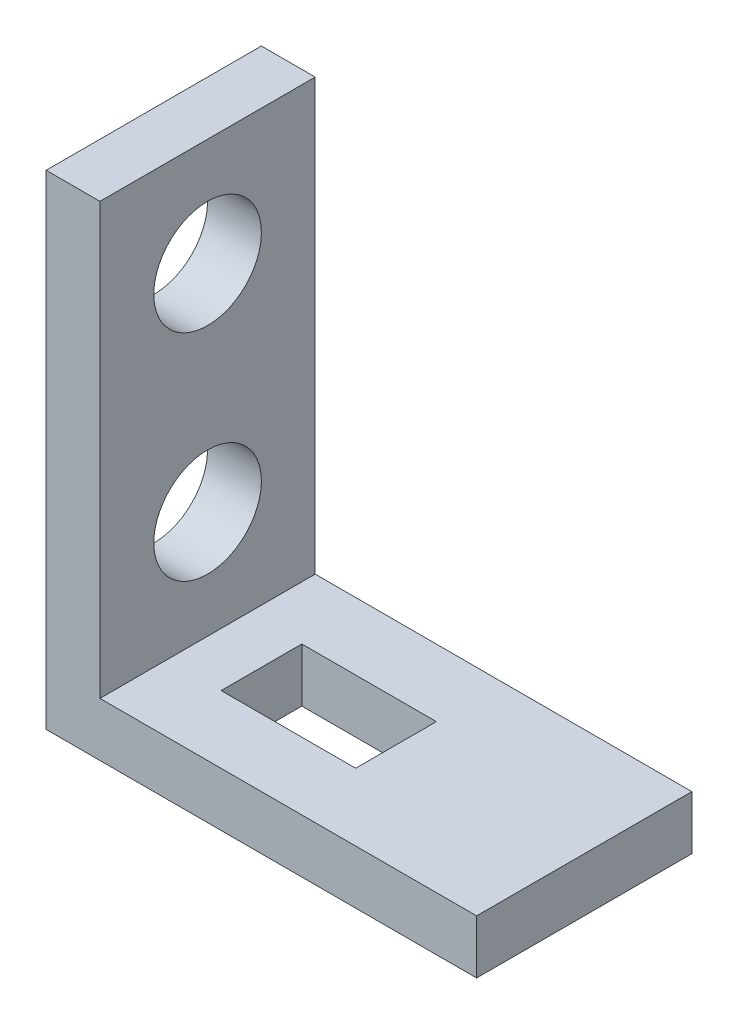
ISO-10303-21;
HEADER;
FILE_DESCRIPTION(('STEP AP214'),'2;1');
FILE_NAME('part.step','',(''),(''),'','','');
FILE_SCHEMA(('AUTOMOTIVE_DESIGN { 1 0 10303 214 1 1 1 1 }'));
ENDSEC;
DATA;
#1=APPLICATION_CONTEXT('core data for automotive mechanical design processes');
#2=APPLICATION_PROTOCOL_DEFINITION('international standard','automotive_design',2000,#1);
#3=PRODUCT_CONTEXT('',#1,'mechanical');
#4=PRODUCT('Part','Part','',(#3));
#5=PRODUCT_RELATED_PRODUCT_CATEGORY('part','',(#4));
#6=PRODUCT_DEFINITION_FORMATION('','',#4);
#7=PRODUCT_DEFINITION_CONTEXT('part definition',#1,'design');
#8=PRODUCT_DEFINITION('design','',#6,#7);
#9=PRODUCT_DEFINITION_SHAPE('','',#8);
#10=(LENGTH_UNIT() NAMED_UNIT(*) SI_UNIT(.MILLI.,.METRE.));
#11=(NAMED_UNIT(*) PLANE_ANGLE_UNIT() SI_UNIT($,.RADIAN.));
#12=(NAMED_UNIT(*) SI_UNIT($,.STERADIAN.) SOLID_ANGLE_UNIT());
#13=UNCERTAINTY_MEASURE_WITH_UNIT(LENGTH_MEASURE(1.E-05),#10,'distance_accuracy_value','');
#14=(GEOMETRIC_REPRESENTATION_CONTEXT(3) GLOBAL_UNCERTAINTY_ASSIGNED_CONTEXT((#13)) GLOBAL_UNIT_ASSIGNED_CONTEXT((#10,
#11,#12)) REPRESENTATION_CONTEXT('',''));
#15=CARTESIAN_POINT('',(0.,0.,0.));
#16=DIRECTION('',(0.,0.,1.));
#17=DIRECTION('',(1.,0.,0.));
#18=AXIS2_PLACEMENT_3D('',#15,#16,#17);
#19=CARTESIAN_POINT('',(0.,0.,12.7));
#20=DIRECTION('',(1.,0.,0.));
#21=DIRECTION('',(0.,0.,-1.));
#22=AXIS2_PLACEMENT_3D('',#19,#20,#21);
#23=PLANE('',#22);
#24=CARTESIAN_POINT('',(0.,9.52499999999999,6.35));
#25=DIRECTION('',(1.,0.,0.));
#26=DIRECTION('',(0.,1.,0.));
#27=AXIS2_PLACEMENT_3D('',#24,#25,#26);
#28=CIRCLE('',#27,3.175);
#29=CARTESIAN_POINT('',(0.,12.7,6.35));
#30=VERTEX_POINT('',#29);
#31=EDGE_CURVE('E145',#30,#30,#28,.T.);
#32=ORIENTED_EDGE('',*,*,#31,.T.);
#33=EDGE_LOOP('',(#32));
#34=FACE_BOUND('',#33,.T.);
#35=CARTESIAN_POINT('',(0.,22.225,6.35));
#36=DIRECTION('',(1.,0.,0.));
#37=DIRECTION('',(0.,1.,0.));
#38=AXIS2_PLACEMENT_3D('',#35,#36,#37);
#39=CIRCLE('',#38,3.175);
#40=CARTESIAN_POINT('',(0.,25.4,6.35));
#41=VERTEX_POINT('',#40);
#42=EDGE_CURVE('E151',#41,#41,#39,.T.);
#43=ORIENTED_EDGE('',*,*,#42,.T.);
#44=EDGE_LOOP('',(#43));
#45=FACE_BOUND('',#44,.T.);
#46=DIRECTION('',(0.,-1.,0.));
#47=VECTOR('',#46,1.);
#48=CARTESIAN_POINT('',(0.,0.,0.));
#49=LINE('',#48,#47);
#50=CARTESIAN_POINT('',(0.,28.575,0.));
#51=VERTEX_POINT('',#50);
#52=CARTESIAN_POINT('',(0.,0.,0.));
#53=VERTEX_POINT('',#52);
#54=EDGE_CURVE('E154',#51,#53,#49,.T.);
#55=ORIENTED_EDGE('',*,*,#54,.T.);
#56=DIRECTION('',(0.,0.,-1.));
#57=VECTOR('',#56,1.);
#58=CARTESIAN_POINT('',(0.,0.,12.7));
#59=LINE('',#58,#57);
#60=CARTESIAN_POINT('',(0.,0.,12.7));
#61=VERTEX_POINT('',#60);
#62=EDGE_CURVE('E11',#61,#53,#59,.T.);
#63=ORIENTED_EDGE('',*,*,#62,.F.);
#64=DIRECTION('',(0.,-1.,0.));
#65=VECTOR('',#64,1.);
#66=CARTESIAN_POINT('',(0.,0.,12.7));
#67=LINE('',#66,#65);
#68=CARTESIAN_POINT('',(0.,28.575,12.7));
#69=VERTEX_POINT('',#68);
#70=EDGE_CURVE('E157',#69,#61,#67,.T.);
#71=ORIENTED_EDGE('',*,*,#70,.F.);
#72=DIRECTION('',(0.,0.,-1.));
#73=VECTOR('',#72,1.);
#74=CARTESIAN_POINT('',(0.,28.575,12.7));
#75=LINE('',#74,#73);
#76=EDGE_CURVE('E171',#69,#51,#75,.T.);
#77=ORIENTED_EDGE('',*,*,#76,.T.);
#78=EDGE_LOOP('',(#55,#63,#71,#77));
#79=FACE_BOUND('',#78,.T.);
#80=ADVANCED_FACE('F32',(#34,#45,#79),#23,.F.);
#81=CARTESIAN_POINT('',(0.,0.,12.7));
#82=DIRECTION('',(0.,1.,0.));
#83=DIRECTION('',(0.,0.,1.));
#84=AXIS2_PLACEMENT_3D('',#81,#82,#83);
#85=PLANE('',#84);
#86=DIRECTION('',(-1.,0.,0.));
#87=VECTOR('',#86,1.);
#88=CARTESIAN_POINT('',(6.35,0.,3.9624));
#89=LINE('',#88,#87);
#90=CARTESIAN_POINT('',(14.2875,0.,3.9624));
#91=VERTEX_POINT('',#90);
#92=CARTESIAN_POINT('',(6.35,0.,3.9624));
#93=VERTEX_POINT('',#92);
#94=EDGE_CURVE('E116',#91,#93,#89,.T.);
#95=ORIENTED_EDGE('',*,*,#94,.T.);
#96=DIRECTION('',(0.,0.,1.));
#97=VECTOR('',#96,1.);
#98=CARTESIAN_POINT('',(6.35,0.,8.7249));
#99=LINE('',#98,#97);
#100=CARTESIAN_POINT('',(6.35,0.,8.7249));
#101=VERTEX_POINT('',#100);
#102=EDGE_CURVE('E110',#93,#101,#99,.T.);
#103=ORIENTED_EDGE('',*,*,#102,.T.);
#104=DIRECTION('',(1.,0.,0.));
#105=VECTOR('',#104,1.);
#106=CARTESIAN_POINT('',(6.35,0.,8.7249));
#107=LINE('',#106,#105);
#108=CARTESIAN_POINT('',(14.2875,0.,8.7249));
#109=VERTEX_POINT('',#108);
#110=EDGE_CURVE('E119',#101,#109,#107,.T.);
#111=ORIENTED_EDGE('',*,*,#110,.T.);
#112=DIRECTION('',(0.,0.,-1.));
#113=VECTOR('',#112,1.);
#114=CARTESIAN_POINT('',(14.2875,0.,8.7249));
#115=LINE('',#114,#113);
#116=EDGE_CURVE('E46',#109,#91,#115,.T.);
#117=ORIENTED_EDGE('',*,*,#116,.T.);
#118=EDGE_LOOP('',(#95,#103,#111,#117));
#119=FACE_BOUND('',#118,.T.);
#120=DIRECTION('',(1.,0.,0.));
#121=VECTOR('',#120,1.);
#122=CARTESIAN_POINT('',(0.,0.,0.));
#123=LINE('',#122,#121);
#124=CARTESIAN_POINT('',(25.4,0.,0.));
#125=VERTEX_POINT('',#124);
#126=EDGE_CURVE('E174',#53,#125,#123,.T.);
#127=ORIENTED_EDGE('',*,*,#126,.T.);
#128=DIRECTION('',(0.,0.,-1.));
#129=VECTOR('',#128,1.);
#130=CARTESIAN_POINT('',(25.4,0.,12.7));
#131=LINE('',#130,#129);
#132=CARTESIAN_POINT('',(25.4,0.,12.7));
#133=VERTEX_POINT('',#132);
#134=EDGE_CURVE('E39',#133,#125,#131,.T.);
#135=ORIENTED_EDGE('',*,*,#134,.F.);
#136=DIRECTION('',(1.,0.,0.));
#137=VECTOR('',#136,1.);
#138=CARTESIAN_POINT('',(0.,0.,12.7));
#139=LINE('',#138,#137);
#140=EDGE_CURVE('E160',#61,#133,#139,.T.);
#141=ORIENTED_EDGE('',*,*,#140,.F.);
#142=ORIENTED_EDGE('',*,*,#62,.T.);
#143=EDGE_LOOP('',(#127,#135,#141,#142));
#144=FACE_BOUND('',#143,.T.);
#145=ADVANCED_FACE('F123',(#119,#144),#85,.F.);
#146=CARTESIAN_POINT('',(25.4,0.,12.7));
#147=DIRECTION('',(-1.,0.,0.));
#148=DIRECTION('',(0.,0.,1.));
#149=AXIS2_PLACEMENT_3D('',#146,#147,#148);
#150=PLANE('',#149);
#151=DIRECTION('',(0.,1.,0.));
#152=VECTOR('',#151,1.);
#153=CARTESIAN_POINT('',(25.4,0.,0.));
#154=LINE('',#153,#152);
#155=CARTESIAN_POINT('',(25.4,3.175,0.));
#156=VERTEX_POINT('',#155);
#157=EDGE_CURVE('E176',#125,#156,#154,.T.);
#158=ORIENTED_EDGE('',*,*,#157,.T.);
#159=DIRECTION('',(0.,0.,-1.));
#160=VECTOR('',#159,1.);
#161=CARTESIAN_POINT('',(25.4,3.175,12.7));
#162=LINE('',#161,#160);
#163=CARTESIAN_POINT('',(25.4,3.175,12.7));
#164=VERTEX_POINT('',#163);
#165=EDGE_CURVE('E191',#164,#156,#162,.T.);
#166=ORIENTED_EDGE('',*,*,#165,.F.);
#167=DIRECTION('',(0.,1.,0.));
#168=VECTOR('',#167,1.);
#169=CARTESIAN_POINT('',(25.4,0.,12.7));
#170=LINE('',#169,#168);
#171=EDGE_CURVE('E163',#133,#164,#170,.T.);
#172=ORIENTED_EDGE('',*,*,#171,.F.);
#173=ORIENTED_EDGE('',*,*,#134,.T.);
#174=EDGE_LOOP('',(#158,#166,#172,#173));
#175=FACE_BOUND('',#174,.T.);
#176=ADVANCED_FACE('F198',(#175),#150,.F.);
#177=CARTESIAN_POINT('',(25.4,3.175,12.7));
#178=DIRECTION('',(0.,-1.,0.));
#179=DIRECTION('',(1.,0.,0.));
#180=AXIS2_PLACEMENT_3D('',#177,#178,#179);
#181=PLANE('',#180);
#182=DIRECTION('',(1.,0.,0.));
#183=VECTOR('',#182,1.);
#184=CARTESIAN_POINT('',(6.35,3.17499999999999,8.7249));
#185=LINE('',#184,#183);
#186=CARTESIAN_POINT('',(6.35000000000001,3.17499999999999,8.7249));
#187=VERTEX_POINT('',#186);
#188=CARTESIAN_POINT('',(14.2875,3.175,8.7249));
#189=VERTEX_POINT('',#188);
#190=EDGE_CURVE('E135',#187,#189,#185,.T.);
#191=ORIENTED_EDGE('',*,*,#190,.F.);
#192=DIRECTION('',(0.,0.,1.));
#193=VECTOR('',#192,1.);
#194=CARTESIAN_POINT('',(6.35,3.17499999999999,8.7249));
#195=LINE('',#194,#193);
#196=CARTESIAN_POINT('',(6.35,3.17499999999999,3.9624));
#197=VERTEX_POINT('',#196);
#198=EDGE_CURVE('E54',#197,#187,#195,.T.);
#199=ORIENTED_EDGE('',*,*,#198,.F.);
#200=DIRECTION('',(-1.,0.,0.));
#201=VECTOR('',#200,1.);
#202=CARTESIAN_POINT('',(6.35,3.17499999999999,3.9624));
#203=LINE('',#202,#201);
#204=CARTESIAN_POINT('',(14.2875,3.175,3.9624));
#205=VERTEX_POINT('',#204);
#206=EDGE_CURVE('E126',#205,#197,#203,.T.);
#207=ORIENTED_EDGE('',*,*,#206,.F.);
#208=DIRECTION('',(0.,0.,-1.));
#209=VECTOR('',#208,1.);
#210=CARTESIAN_POINT('',(14.2875,3.175,8.7249));
#211=LINE('',#210,#209);
#212=EDGE_CURVE('E129',#189,#205,#211,.T.);
#213=ORIENTED_EDGE('',*,*,#212,.F.);
#214=EDGE_LOOP('',(#191,#199,#207,#213));
#215=FACE_BOUND('',#214,.T.);
#216=DIRECTION('',(-1.,0.,0.));
#217=VECTOR('',#216,1.);
#218=CARTESIAN_POINT('',(25.4,3.175,0.));
#219=LINE('',#218,#217);
#220=CARTESIAN_POINT('',(3.175,3.17499999999999,0.));
#221=VERTEX_POINT('',#220);
#222=EDGE_CURVE('E178',#156,#221,#219,.T.);
#223=ORIENTED_EDGE('',*,*,#222,.T.);
#224=DIRECTION('',(0.,0.,-1.));
#225=VECTOR('',#224,1.);
#226=CARTESIAN_POINT('',(3.175,3.17499999999999,12.7));
#227=LINE('',#226,#225);
#228=CARTESIAN_POINT('',(3.175,3.17499999999999,12.7));
#229=VERTEX_POINT('',#228);
#230=EDGE_CURVE('E188',#229,#221,#227,.T.);
#231=ORIENTED_EDGE('',*,*,#230,.F.);
#232=DIRECTION('',(-1.,0.,0.));
#233=VECTOR('',#232,1.);
#234=CARTESIAN_POINT('',(25.4,3.175,12.7));
#235=LINE('',#234,#233);
#236=EDGE_CURVE('E165',#164,#229,#235,.T.);
#237=ORIENTED_EDGE('',*,*,#236,.F.);
#238=ORIENTED_EDGE('',*,*,#165,.T.);
#239=EDGE_LOOP('',(#223,#231,#237,#238));
#240=FACE_BOUND('',#239,.T.);
#241=ADVANCED_FACE('F208',(#215,#240),#181,.F.);
#242=CARTESIAN_POINT('',(3.175,28.575,12.7));
#243=DIRECTION('',(-1.,0.,0.));
#244=DIRECTION('',(0.,-1.,0.));
#245=AXIS2_PLACEMENT_3D('',#242,#243,#244);
#246=PLANE('',#245);
#247=CARTESIAN_POINT('',(3.175,9.52499999999999,6.35));
#248=DIRECTION('',(1.,0.,0.));
#249=DIRECTION('',(0.,1.,0.));
#250=AXIS2_PLACEMENT_3D('',#247,#248,#249);
#251=CIRCLE('',#250,3.175);
#252=CARTESIAN_POINT('',(3.175,12.7,6.35));
#253=VERTEX_POINT('',#252);
#254=EDGE_CURVE('E141',#253,#253,#251,.T.);
#255=ORIENTED_EDGE('',*,*,#254,.F.);
#256=EDGE_LOOP('',(#255));
#257=FACE_BOUND('',#256,.T.);
#258=CARTESIAN_POINT('',(3.175,22.225,6.35));
#259=DIRECTION('',(1.,0.,0.));
#260=DIRECTION('',(0.,1.,0.));
#261=AXIS2_PLACEMENT_3D('',#258,#259,#260);
#262=CIRCLE('',#261,3.175);
#263=CARTESIAN_POINT('',(3.175,25.4,6.35));
#264=VERTEX_POINT('',#263);
#265=EDGE_CURVE('E148',#264,#264,#262,.T.);
#266=ORIENTED_EDGE('',*,*,#265,.F.);
#267=EDGE_LOOP('',(#266));
#268=FACE_BOUND('',#267,.T.);
#269=DIRECTION('',(0.,1.,0.));
#270=VECTOR('',#269,1.);
#271=CARTESIAN_POINT('',(3.175,28.575,0.));
#272=LINE('',#271,#270);
#273=CARTESIAN_POINT('',(3.175,28.575,0.));
#274=VERTEX_POINT('',#273);
#275=EDGE_CURVE('E180',#221,#274,#272,.T.);
#276=ORIENTED_EDGE('',*,*,#275,.T.);
#277=DIRECTION('',(0.,0.,-1.));
#278=VECTOR('',#277,1.);
#279=CARTESIAN_POINT('',(3.175,28.575,12.7));
#280=LINE('',#279,#278);
#281=CARTESIAN_POINT('',(3.175,28.575,12.7));
#282=VERTEX_POINT('',#281);
#283=EDGE_CURVE('E185',#282,#274,#280,.T.);
#284=ORIENTED_EDGE('',*,*,#283,.F.);
#285=DIRECTION('',(0.,1.,0.));
#286=VECTOR('',#285,1.);
#287=CARTESIAN_POINT('',(3.175,28.575,12.7));
#288=LINE('',#287,#286);
#289=EDGE_CURVE('E167',#229,#282,#288,.T.);
#290=ORIENTED_EDGE('',*,*,#289,.F.);
#291=ORIENTED_EDGE('',*,*,#230,.T.);
#292=EDGE_LOOP('',(#276,#284,#290,#291));
#293=FACE_BOUND('',#292,.T.);
#294=ADVANCED_FACE('F212',(#257,#268,#293),#246,.F.);
#295=CARTESIAN_POINT('',(0.,28.575,12.7));
#296=DIRECTION('',(0.,-1.,0.));
#297=DIRECTION('',(0.,0.,-1.));
#298=AXIS2_PLACEMENT_3D('',#295,#296,#297);
#299=PLANE('',#298);
#300=DIRECTION('',(-1.,0.,0.));
#301=VECTOR('',#300,1.);
#302=CARTESIAN_POINT('',(0.,28.575,0.));
#303=LINE('',#302,#301);
#304=EDGE_CURVE('E161',#274,#51,#303,.T.);
#305=ORIENTED_EDGE('',*,*,#304,.T.);
#306=ORIENTED_EDGE('',*,*,#76,.F.);
#307=DIRECTION('',(-1.,0.,0.));
#308=VECTOR('',#307,1.);
#309=CARTESIAN_POINT('',(0.,28.575,12.7));
#310=LINE('',#309,#308);
#311=EDGE_CURVE('E169',#282,#69,#310,.T.);
#312=ORIENTED_EDGE('',*,*,#311,.F.);
#313=ORIENTED_EDGE('',*,*,#283,.T.);
#314=EDGE_LOOP('',(#305,#306,#312,#313));
#315=FACE_BOUND('',#314,.T.);
#316=ADVANCED_FACE('F222',(#315),#299,.F.);
#317=CARTESIAN_POINT('',(0.,0.,12.7));
#318=DIRECTION('',(0.,0.,-1.));
#319=DIRECTION('',(-1.,0.,0.));
#320=AXIS2_PLACEMENT_3D('',#317,#318,#319);
#321=PLANE('',#320);
#322=ORIENTED_EDGE('',*,*,#70,.T.);
#323=ORIENTED_EDGE('',*,*,#140,.T.);
#324=ORIENTED_EDGE('',*,*,#171,.T.);
#325=ORIENTED_EDGE('',*,*,#236,.T.);
#326=ORIENTED_EDGE('',*,*,#289,.T.);
#327=ORIENTED_EDGE('',*,*,#311,.T.);
#328=EDGE_LOOP('',(#322,#323,#324,#325,#326,#327));
#329=FACE_BOUND('',#328,.T.);
#330=ADVANCED_FACE('F216',(#329),#321,.F.);
#331=CARTESIAN_POINT('',(0.,0.,0.));
#332=DIRECTION('',(0.,0.,-1.));
#333=DIRECTION('',(-1.,0.,0.));
#334=AXIS2_PLACEMENT_3D('',#331,#332,#333);
#335=PLANE('',#334);
#336=ORIENTED_EDGE('',*,*,#54,.F.);
#337=ORIENTED_EDGE('',*,*,#304,.F.);
#338=ORIENTED_EDGE('',*,*,#275,.F.);
#339=ORIENTED_EDGE('',*,*,#222,.F.);
#340=ORIENTED_EDGE('',*,*,#157,.F.);
#341=ORIENTED_EDGE('',*,*,#126,.F.);
#342=EDGE_LOOP('',(#336,#337,#338,#339,#340,#341));
#343=FACE_BOUND('',#342,.T.);
#344=ADVANCED_FACE('F203',(#343),#335,.T.);
#345=CARTESIAN_POINT('',(0.,22.225,6.35));
#346=DIRECTION('',(1.,0.,0.));
#347=DIRECTION('',(0.,1.,0.));
#348=AXIS2_PLACEMENT_3D('',#345,#346,#347);
#349=CYLINDRICAL_SURFACE('',#348,3.175);
#350=ORIENTED_EDGE('',*,*,#42,.F.);
#351=EDGE_LOOP('',(#350));
#352=FACE_BOUND('',#351,.T.);
#353=ORIENTED_EDGE('',*,*,#265,.T.);
#354=EDGE_LOOP('',(#353));
#355=FACE_BOUND('',#354,.T.);
#356=ADVANCED_FACE('F242',(#352,#355),#349,.F.);
#357=CARTESIAN_POINT('',(0.,9.52499999999999,6.35));
#358=DIRECTION('',(1.,0.,0.));
#359=DIRECTION('',(0.,1.,0.));
#360=AXIS2_PLACEMENT_3D('',#357,#358,#359);
#361=CYLINDRICAL_SURFACE('',#360,3.175);
#362=ORIENTED_EDGE('',*,*,#31,.F.);
#363=EDGE_LOOP('',(#362));
#364=FACE_BOUND('',#363,.T.);
#365=ORIENTED_EDGE('',*,*,#254,.T.);
#366=EDGE_LOOP('',(#365));
#367=FACE_BOUND('',#366,.T.);
#368=ADVANCED_FACE('F245',(#364,#367),#361,.F.);
#369=CARTESIAN_POINT('',(6.35,0.,8.7249));
#370=DIRECTION('',(-1.,0.,0.));
#371=DIRECTION('',(0.,-1.,0.));
#372=AXIS2_PLACEMENT_3D('',#369,#370,#371);
#373=PLANE('',#372);
#374=ORIENTED_EDGE('',*,*,#198,.T.);
#375=DIRECTION('',(0.,1.,0.));
#376=VECTOR('',#375,1.);
#377=CARTESIAN_POINT('',(6.35,0.,8.7249));
#378=LINE('',#377,#376);
#379=EDGE_CURVE('E106',#101,#187,#378,.T.);
#380=ORIENTED_EDGE('',*,*,#379,.F.);
#381=ORIENTED_EDGE('',*,*,#102,.F.);
#382=DIRECTION('',(0.,1.,0.));
#383=VECTOR('',#382,1.);
#384=CARTESIAN_POINT('',(6.35,0.,3.9624));
#385=LINE('',#384,#383);
#386=EDGE_CURVE('E139',#93,#197,#385,.T.);
#387=ORIENTED_EDGE('',*,*,#386,.T.);
#388=EDGE_LOOP('',(#374,#380,#381,#387));
#389=FACE_BOUND('',#388,.T.);
#390=ADVANCED_FACE('F108',(#389),#373,.F.);
#391=CARTESIAN_POINT('',(6.35,0.,3.9624));
#392=DIRECTION('',(0.,0.,-1.));
#393=DIRECTION('',(-1.,0.,0.));
#394=AXIS2_PLACEMENT_3D('',#391,#392,#393);
#395=PLANE('',#394);
#396=ORIENTED_EDGE('',*,*,#206,.T.);
#397=ORIENTED_EDGE('',*,*,#386,.F.);
#398=ORIENTED_EDGE('',*,*,#94,.F.);
#399=DIRECTION('',(0.,1.,0.));
#400=VECTOR('',#399,1.);
#401=CARTESIAN_POINT('',(14.2875,0.,3.9624));
#402=LINE('',#401,#400);
#403=EDGE_CURVE('E142',#91,#205,#402,.T.);
#404=ORIENTED_EDGE('',*,*,#403,.T.);
#405=EDGE_LOOP('',(#396,#397,#398,#404));
#406=FACE_BOUND('',#405,.T.);
#407=ADVANCED_FACE('F258',(#406),#395,.F.);
#408=CARTESIAN_POINT('',(14.2875,0.,8.7249));
#409=DIRECTION('',(1.,0.,0.));
#410=DIRECTION('',(0.,1.,0.));
#411=AXIS2_PLACEMENT_3D('',#408,#409,#410);
#412=PLANE('',#411);
#413=ORIENTED_EDGE('',*,*,#212,.T.);
#414=ORIENTED_EDGE('',*,*,#403,.F.);
#415=ORIENTED_EDGE('',*,*,#116,.F.);
#416=DIRECTION('',(0.,1.,0.));
#417=VECTOR('',#416,1.);
#418=CARTESIAN_POINT('',(14.2875,0.,8.7249));
#419=LINE('',#418,#417);
#420=EDGE_CURVE('E115',#109,#189,#419,.T.);
#421=ORIENTED_EDGE('',*,*,#420,.T.);
#422=EDGE_LOOP('',(#413,#414,#415,#421));
#423=FACE_BOUND('',#422,.T.);
#424=ADVANCED_FACE('F261',(#423),#412,.F.);
#425=CARTESIAN_POINT('',(6.35,0.,8.7249));
#426=DIRECTION('',(0.,0.,1.));
#427=DIRECTION('',(1.,0.,0.));
#428=AXIS2_PLACEMENT_3D('',#425,#426,#427);
#429=PLANE('',#428);
#430=ORIENTED_EDGE('',*,*,#190,.T.);
#431=ORIENTED_EDGE('',*,*,#420,.F.);
#432=ORIENTED_EDGE('',*,*,#110,.F.);
#433=ORIENTED_EDGE('',*,*,#379,.T.);
#434=EDGE_LOOP('',(#430,#431,#432,#433));
#435=FACE_BOUND('',#434,.T.);
#436=ADVANCED_FACE('F120',(#435),#429,.F.);
#437=CLOSED_SHELL('',(#80,#145,#176,#241,#294,#316,#330,#344,#356,#368,#390,#407,#424,#436));
#438=MANIFOLD_SOLID_BREP('B2',#437);
#439=ADVANCED_BREP_SHAPE_REPRESENTATION('',(#18,#438),#14);
#440=SHAPE_DEFINITION_REPRESENTATION(#9,#439);
ENDSEC;
END-ISO-10303-21;
